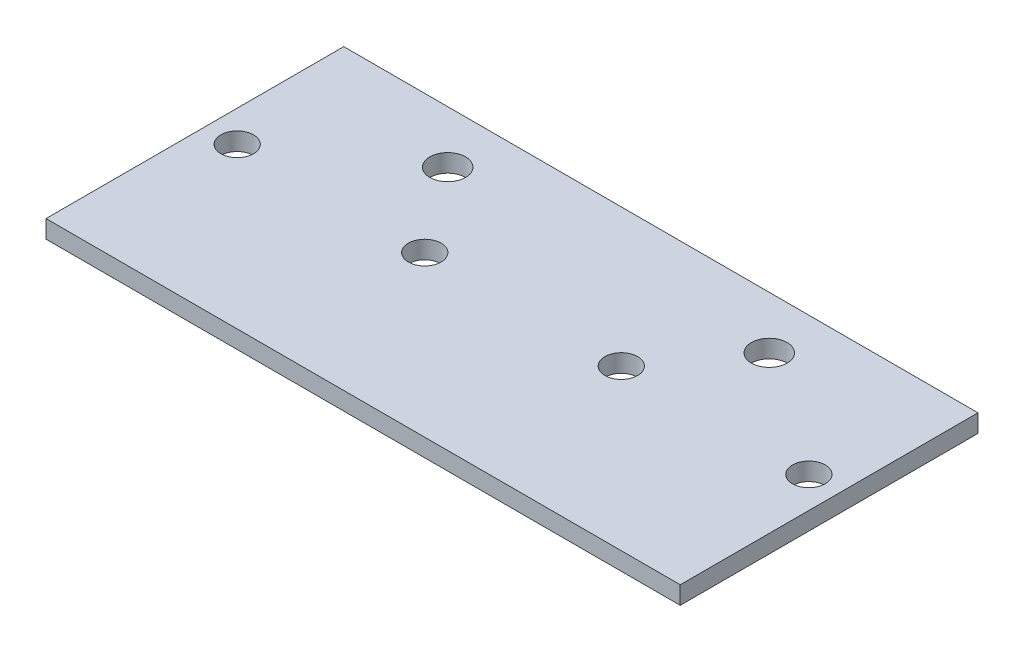
ISO-10303-21;
HEADER;
FILE_DESCRIPTION(('STEP AP214'),'2;1');
FILE_NAME('part.step','',(''),(''),'','','');
FILE_SCHEMA(('AUTOMOTIVE_DESIGN { 1 0 10303 214 1 1 1 1 }'));
ENDSEC;
DATA;
#1=APPLICATION_CONTEXT('core data for automotive mechanical design processes');
#2=APPLICATION_PROTOCOL_DEFINITION('international standard','automotive_design',2000,#1);
#3=PRODUCT_CONTEXT('',#1,'mechanical');
#4=PRODUCT('Part','Part','',(#3));
#5=PRODUCT_RELATED_PRODUCT_CATEGORY('part','',(#4));
#6=PRODUCT_DEFINITION_FORMATION('','',#4);
#7=PRODUCT_DEFINITION_CONTEXT('part definition',#1,'design');
#8=PRODUCT_DEFINITION('design','',#6,#7);
#9=PRODUCT_DEFINITION_SHAPE('','',#8);
#10=(LENGTH_UNIT() NAMED_UNIT(*) SI_UNIT(.MILLI.,.METRE.));
#11=(NAMED_UNIT(*) PLANE_ANGLE_UNIT() SI_UNIT($,.RADIAN.));
#12=(NAMED_UNIT(*) SI_UNIT($,.STERADIAN.) SOLID_ANGLE_UNIT());
#13=UNCERTAINTY_MEASURE_WITH_UNIT(LENGTH_MEASURE(1.E-05),#10,'distance_accuracy_value','');
#14=(GEOMETRIC_REPRESENTATION_CONTEXT(3) GLOBAL_UNCERTAINTY_ASSIGNED_CONTEXT((#13)) GLOBAL_UNIT_ASSIGNED_CONTEXT((#10,
#11,#12)) REPRESENTATION_CONTEXT('',''));
#15=CARTESIAN_POINT('',(0.,0.,0.));
#16=DIRECTION('',(0.,0.,1.));
#17=DIRECTION('',(1.,0.,0.));
#18=AXIS2_PLACEMENT_3D('',#15,#16,#17);
#19=CARTESIAN_POINT('',(53.25,3.,25.));
#20=DIRECTION('',(-1.,0.,0.));
#21=DIRECTION('',(0.,0.,1.));
#22=AXIS2_PLACEMENT_3D('',#19,#20,#21);
#23=PLANE('',#22);
#24=DIRECTION('',(0.,0.,-1.));
#25=VECTOR('',#24,1.);
#26=CARTESIAN_POINT('',(53.25,0.,25.));
#27=LINE('',#26,#25);
#28=CARTESIAN_POINT('',(53.25,0.,25.));
#29=VERTEX_POINT('',#28);
#30=CARTESIAN_POINT('',(53.25,0.,-25.));
#31=VERTEX_POINT('',#30);
#32=EDGE_CURVE('E95',#29,#31,#27,.T.);
#33=ORIENTED_EDGE('',*,*,#32,.T.);
#34=DIRECTION('',(0.,-1.,0.));
#35=VECTOR('',#34,1.);
#36=CARTESIAN_POINT('',(53.25,3.,-25.));
#37=LINE('',#36,#35);
#38=CARTESIAN_POINT('',(53.25,3.,-25.));
#39=VERTEX_POINT('',#38);
#40=EDGE_CURVE('E11',#39,#31,#37,.T.);
#41=ORIENTED_EDGE('',*,*,#40,.F.);
#42=DIRECTION('',(0.,0.,-1.));
#43=VECTOR('',#42,1.);
#44=CARTESIAN_POINT('',(53.25,3.,25.));
#45=LINE('',#44,#43);
#46=CARTESIAN_POINT('',(53.25,3.,25.));
#47=VERTEX_POINT('',#46);
#48=EDGE_CURVE('E83',#47,#39,#45,.T.);
#49=ORIENTED_EDGE('',*,*,#48,.F.);
#50=DIRECTION('',(0.,-1.,0.));
#51=VECTOR('',#50,1.);
#52=CARTESIAN_POINT('',(53.25,3.,25.));
#53=LINE('',#52,#51);
#54=EDGE_CURVE('E91',#47,#29,#53,.T.);
#55=ORIENTED_EDGE('',*,*,#54,.T.);
#56=EDGE_LOOP('',(#33,#41,#49,#55));
#57=FACE_BOUND('',#56,.T.);
#58=ADVANCED_FACE('F32',(#57),#23,.F.);
#59=CARTESIAN_POINT('',(-53.25,3.,-25.));
#60=DIRECTION('',(0.,0.,1.));
#61=DIRECTION('',(1.,0.,0.));
#62=AXIS2_PLACEMENT_3D('',#59,#60,#61);
#63=PLANE('',#62);
#64=DIRECTION('',(-1.,0.,0.));
#65=VECTOR('',#64,1.);
#66=CARTESIAN_POINT('',(-53.25,0.,-25.));
#67=LINE('',#66,#65);
#68=CARTESIAN_POINT('',(-53.25,0.,-25.));
#69=VERTEX_POINT('',#68);
#70=EDGE_CURVE('E87',#31,#69,#67,.T.);
#71=ORIENTED_EDGE('',*,*,#70,.T.);
#72=DIRECTION('',(0.,-1.,0.));
#73=VECTOR('',#72,1.);
#74=CARTESIAN_POINT('',(-53.25,3.,-25.));
#75=LINE('',#74,#73);
#76=CARTESIAN_POINT('',(-53.25,3.,-25.));
#77=VERTEX_POINT('',#76);
#78=EDGE_CURVE('E40',#77,#69,#75,.T.);
#79=ORIENTED_EDGE('',*,*,#78,.F.);
#80=DIRECTION('',(-1.,0.,0.));
#81=VECTOR('',#80,1.);
#82=CARTESIAN_POINT('',(-53.25,3.,-25.));
#83=LINE('',#82,#81);
#84=EDGE_CURVE('E78',#39,#77,#83,.T.);
#85=ORIENTED_EDGE('',*,*,#84,.F.);
#86=ORIENTED_EDGE('',*,*,#40,.T.);
#87=EDGE_LOOP('',(#71,#79,#85,#86));
#88=FACE_BOUND('',#87,.T.);
#89=ADVANCED_FACE('F86',(#88),#63,.F.);
#90=CARTESIAN_POINT('',(-53.25,3.,25.));
#91=DIRECTION('',(1.,0.,0.));
#92=DIRECTION('',(0.,0.,-1.));
#93=AXIS2_PLACEMENT_3D('',#90,#91,#92);
#94=PLANE('',#93);
#95=DIRECTION('',(0.,0.,1.));
#96=VECTOR('',#95,1.);
#97=CARTESIAN_POINT('',(-53.25,0.,25.));
#98=LINE('',#97,#96);
#99=CARTESIAN_POINT('',(-53.25,0.,25.));
#100=VERTEX_POINT('',#99);
#101=EDGE_CURVE('E65',#69,#100,#98,.T.);
#102=ORIENTED_EDGE('',*,*,#101,.T.);
#103=DIRECTION('',(0.,-1.,0.));
#104=VECTOR('',#103,1.);
#105=CARTESIAN_POINT('',(-53.25,3.,25.));
#106=LINE('',#105,#104);
#107=CARTESIAN_POINT('',(-53.25,3.,25.));
#108=VERTEX_POINT('',#107);
#109=EDGE_CURVE('E88',#108,#100,#106,.T.);
#110=ORIENTED_EDGE('',*,*,#109,.F.);
#111=DIRECTION('',(0.,0.,1.));
#112=VECTOR('',#111,1.);
#113=CARTESIAN_POINT('',(-53.25,3.,25.));
#114=LINE('',#113,#112);
#115=EDGE_CURVE('E81',#77,#108,#114,.T.);
#116=ORIENTED_EDGE('',*,*,#115,.F.);
#117=ORIENTED_EDGE('',*,*,#78,.T.);
#118=EDGE_LOOP('',(#102,#110,#116,#117));
#119=FACE_BOUND('',#118,.T.);
#120=ADVANCED_FACE('F89',(#119),#94,.F.);
#121=CARTESIAN_POINT('',(-53.25,3.,25.));
#122=DIRECTION('',(0.,0.,-1.));
#123=DIRECTION('',(-1.,0.,0.));
#124=AXIS2_PLACEMENT_3D('',#121,#122,#123);
#125=PLANE('',#124);
#126=DIRECTION('',(1.,0.,0.));
#127=VECTOR('',#126,1.);
#128=CARTESIAN_POINT('',(-53.25,0.,25.));
#129=LINE('',#128,#127);
#130=EDGE_CURVE('E71',#100,#29,#129,.T.);
#131=ORIENTED_EDGE('',*,*,#130,.T.);
#132=ORIENTED_EDGE('',*,*,#54,.F.);
#133=DIRECTION('',(1.,0.,0.));
#134=VECTOR('',#133,1.);
#135=CARTESIAN_POINT('',(-53.25,3.,25.));
#136=LINE('',#135,#134);
#137=EDGE_CURVE('E48',#108,#47,#136,.T.);
#138=ORIENTED_EDGE('',*,*,#137,.F.);
#139=ORIENTED_EDGE('',*,*,#109,.T.);
#140=EDGE_LOOP('',(#131,#132,#138,#139));
#141=FACE_BOUND('',#140,.T.);
#142=ADVANCED_FACE('F103',(#141),#125,.F.);
#143=CARTESIAN_POINT('',(0.,3.,0.));
#144=DIRECTION('',(0.,-1.,0.));
#145=DIRECTION('',(0.,0.,-1.));
#146=AXIS2_PLACEMENT_3D('',#143,#144,#145);
#147=PLANE('',#146);
#148=CARTESIAN_POINT('',(-26.9999999999996,3.,-16.2000000000578));
#149=DIRECTION('',(0.,1.,0.));
#150=DIRECTION('',(0.,0.,1.));
#151=AXIS2_PLACEMENT_3D('',#148,#149,#150);
#152=CIRCLE('',#151,3.00000000000002);
#153=CARTESIAN_POINT('',(-26.9999999999996,3.,-13.2000000000578));
#154=VERTEX_POINT('',#153);
#155=EDGE_CURVE('E139',#154,#154,#152,.T.);
#156=ORIENTED_EDGE('',*,*,#155,.F.);
#157=EDGE_LOOP('',(#156));
#158=FACE_BOUND('',#157,.T.);
#159=CARTESIAN_POINT('',(27.0000000000004,3.,-16.2000000000578));
#160=DIRECTION('',(0.,1.,0.));
#161=DIRECTION('',(0.,0.,1.));
#162=AXIS2_PLACEMENT_3D('',#159,#160,#161);
#163=CIRCLE('',#162,2.99999999999999);
#164=CARTESIAN_POINT('',(27.0000000000004,3.,-13.2000000000578));
#165=VERTEX_POINT('',#164);
#166=EDGE_CURVE('E133',#165,#165,#163,.T.);
#167=ORIENTED_EDGE('',*,*,#166,.F.);
#168=EDGE_LOOP('',(#167));
#169=FACE_BOUND('',#168,.T.);
#170=CARTESIAN_POINT('',(-47.9999999999934,3.,-1.8500000000346));
#171=DIRECTION('',(0.,1.,0.));
#172=DIRECTION('',(0.,0.,1.));
#173=AXIS2_PLACEMENT_3D('',#170,#171,#172);
#174=CIRCLE('',#173,2.74999999999999);
#175=CARTESIAN_POINT('',(-47.9999999999934,3.,0.899999999965393));
#176=VERTEX_POINT('',#175);
#177=EDGE_CURVE('E127',#176,#176,#174,.T.);
#178=ORIENTED_EDGE('',*,*,#177,.F.);
#179=EDGE_LOOP('',(#178));
#180=FACE_BOUND('',#179,.T.);
#181=CARTESIAN_POINT('',(-16.4999999999934,3.,-1.8500000000346));
#182=DIRECTION('',(0.,1.,0.));
#183=DIRECTION('',(0.,0.,1.));
#184=AXIS2_PLACEMENT_3D('',#181,#182,#183);
#185=CIRCLE('',#184,2.75000000000002);
#186=CARTESIAN_POINT('',(-16.4999999999934,3.,0.89999999996542));
#187=VERTEX_POINT('',#186);
#188=EDGE_CURVE('E121',#187,#187,#185,.T.);
#189=ORIENTED_EDGE('',*,*,#188,.F.);
#190=EDGE_LOOP('',(#189));
#191=FACE_BOUND('',#190,.T.);
#192=CARTESIAN_POINT('',(16.5000000000057,3.,-1.85000000006413));
#193=DIRECTION('',(0.,1.,0.));
#194=DIRECTION('',(0.,0.,1.));
#195=AXIS2_PLACEMENT_3D('',#192,#193,#194);
#196=CIRCLE('',#195,2.75000000000002);
#197=CARTESIAN_POINT('',(16.5000000000057,3.,0.899999999935885));
#198=VERTEX_POINT('',#197);
#199=EDGE_CURVE('E115',#198,#198,#196,.T.);
#200=ORIENTED_EDGE('',*,*,#199,.F.);
#201=EDGE_LOOP('',(#200));
#202=FACE_BOUND('',#201,.T.);
#203=CARTESIAN_POINT('',(48.0000000000057,3.,-1.85000000006413));
#204=DIRECTION('',(0.,1.,0.));
#205=DIRECTION('',(0.,0.,1.));
#206=AXIS2_PLACEMENT_3D('',#203,#204,#205);
#207=CIRCLE('',#206,2.74999999999999);
#208=CARTESIAN_POINT('',(48.0000000000057,3.,0.899999999935861));
#209=VERTEX_POINT('',#208);
#210=EDGE_CURVE('E109',#209,#209,#207,.T.);
#211=ORIENTED_EDGE('',*,*,#210,.F.);
#212=EDGE_LOOP('',(#211));
#213=FACE_BOUND('',#212,.T.);
#214=ORIENTED_EDGE('',*,*,#48,.T.);
#215=ORIENTED_EDGE('',*,*,#84,.T.);
#216=ORIENTED_EDGE('',*,*,#115,.T.);
#217=ORIENTED_EDGE('',*,*,#137,.T.);
#218=EDGE_LOOP('',(#214,#215,#216,#217));
#219=FACE_BOUND('',#218,.T.);
#220=ADVANCED_FACE('F79',(#158,#169,#180,#191,#202,#213,#219),#147,.F.);
#221=CARTESIAN_POINT('',(0.,0.,0.));
#222=DIRECTION('',(0.,-1.,0.));
#223=DIRECTION('',(0.,0.,-1.));
#224=AXIS2_PLACEMENT_3D('',#221,#222,#223);
#225=PLANE('',#224);
#226=CARTESIAN_POINT('',(-26.9999999999996,0.,-16.2000000000578));
#227=DIRECTION('',(0.,1.,0.));
#228=DIRECTION('',(0.,0.,1.));
#229=AXIS2_PLACEMENT_3D('',#226,#227,#228);
#230=CIRCLE('',#229,3.00000000000002);
#231=CARTESIAN_POINT('',(-26.9999999999996,0.,-13.2000000000578));
#232=VERTEX_POINT('',#231);
#233=EDGE_CURVE('E136',#232,#232,#230,.T.);
#234=ORIENTED_EDGE('',*,*,#233,.T.);
#235=EDGE_LOOP('',(#234));
#236=FACE_BOUND('',#235,.T.);
#237=CARTESIAN_POINT('',(27.0000000000004,0.,-16.2000000000578));
#238=DIRECTION('',(0.,1.,0.));
#239=DIRECTION('',(0.,0.,1.));
#240=AXIS2_PLACEMENT_3D('',#237,#238,#239);
#241=CIRCLE('',#240,2.99999999999999);
#242=CARTESIAN_POINT('',(27.0000000000004,0.,-13.2000000000578));
#243=VERTEX_POINT('',#242);
#244=EDGE_CURVE('E130',#243,#243,#241,.T.);
#245=ORIENTED_EDGE('',*,*,#244,.T.);
#246=EDGE_LOOP('',(#245));
#247=FACE_BOUND('',#246,.T.);
#248=CARTESIAN_POINT('',(-47.9999999999934,0.,-1.8500000000346));
#249=DIRECTION('',(0.,1.,0.));
#250=DIRECTION('',(0.,0.,1.));
#251=AXIS2_PLACEMENT_3D('',#248,#249,#250);
#252=CIRCLE('',#251,2.74999999999999);
#253=CARTESIAN_POINT('',(-47.9999999999934,0.,0.899999999965393));
#254=VERTEX_POINT('',#253);
#255=EDGE_CURVE('E124',#254,#254,#252,.T.);
#256=ORIENTED_EDGE('',*,*,#255,.T.);
#257=EDGE_LOOP('',(#256));
#258=FACE_BOUND('',#257,.T.);
#259=CARTESIAN_POINT('',(-16.4999999999934,0.,-1.8500000000346));
#260=DIRECTION('',(0.,1.,0.));
#261=DIRECTION('',(0.,0.,1.));
#262=AXIS2_PLACEMENT_3D('',#259,#260,#261);
#263=CIRCLE('',#262,2.75000000000002);
#264=CARTESIAN_POINT('',(-16.4999999999934,0.,0.89999999996542));
#265=VERTEX_POINT('',#264);
#266=EDGE_CURVE('E118',#265,#265,#263,.T.);
#267=ORIENTED_EDGE('',*,*,#266,.T.);
#268=EDGE_LOOP('',(#267));
#269=FACE_BOUND('',#268,.T.);
#270=CARTESIAN_POINT('',(16.5000000000057,0.,-1.85000000006413));
#271=DIRECTION('',(0.,1.,0.));
#272=DIRECTION('',(0.,0.,1.));
#273=AXIS2_PLACEMENT_3D('',#270,#271,#272);
#274=CIRCLE('',#273,2.75000000000002);
#275=CARTESIAN_POINT('',(16.5000000000057,0.,0.899999999935885));
#276=VERTEX_POINT('',#275);
#277=EDGE_CURVE('E112',#276,#276,#274,.T.);
#278=ORIENTED_EDGE('',*,*,#277,.T.);
#279=EDGE_LOOP('',(#278));
#280=FACE_BOUND('',#279,.T.);
#281=CARTESIAN_POINT('',(48.0000000000057,0.,-1.85000000006413));
#282=DIRECTION('',(0.,1.,0.));
#283=DIRECTION('',(0.,0.,1.));
#284=AXIS2_PLACEMENT_3D('',#281,#282,#283);
#285=CIRCLE('',#284,2.74999999999999);
#286=CARTESIAN_POINT('',(48.0000000000057,0.,0.899999999935861));
#287=VERTEX_POINT('',#286);
#288=EDGE_CURVE('E98',#287,#287,#285,.T.);
#289=ORIENTED_EDGE('',*,*,#288,.T.);
#290=EDGE_LOOP('',(#289));
#291=FACE_BOUND('',#290,.T.);
#292=ORIENTED_EDGE('',*,*,#32,.F.);
#293=ORIENTED_EDGE('',*,*,#130,.F.);
#294=ORIENTED_EDGE('',*,*,#101,.F.);
#295=ORIENTED_EDGE('',*,*,#70,.F.);
#296=EDGE_LOOP('',(#292,#293,#294,#295));
#297=FACE_BOUND('',#296,.T.);
#298=ADVANCED_FACE('F106',(#236,#247,#258,#269,#280,#291,#297),#225,.T.);
#299=CARTESIAN_POINT('',(48.0000000000057,0.,-1.85000000006413));
#300=DIRECTION('',(0.,1.,0.));
#301=DIRECTION('',(0.,0.,1.));
#302=AXIS2_PLACEMENT_3D('',#299,#300,#301);
#303=CYLINDRICAL_SURFACE('',#302,2.74999999999999);
#304=ORIENTED_EDGE('',*,*,#288,.F.);
#305=EDGE_LOOP('',(#304));
#306=FACE_BOUND('',#305,.T.);
#307=ORIENTED_EDGE('',*,*,#210,.T.);
#308=EDGE_LOOP('',(#307));
#309=FACE_BOUND('',#308,.T.);
#310=ADVANCED_FACE('F167',(#306,#309),#303,.F.);
#311=CARTESIAN_POINT('',(16.5000000000057,0.,-1.85000000006413));
#312=DIRECTION('',(0.,1.,0.));
#313=DIRECTION('',(0.,0.,1.));
#314=AXIS2_PLACEMENT_3D('',#311,#312,#313);
#315=CYLINDRICAL_SURFACE('',#314,2.75000000000002);
#316=ORIENTED_EDGE('',*,*,#277,.F.);
#317=EDGE_LOOP('',(#316));
#318=FACE_BOUND('',#317,.T.);
#319=ORIENTED_EDGE('',*,*,#199,.T.);
#320=EDGE_LOOP('',(#319));
#321=FACE_BOUND('',#320,.T.);
#322=ADVANCED_FACE('F169',(#318,#321),#315,.F.);
#323=CARTESIAN_POINT('',(-16.4999999999934,0.,-1.8500000000346));
#324=DIRECTION('',(0.,1.,0.));
#325=DIRECTION('',(0.,0.,1.));
#326=AXIS2_PLACEMENT_3D('',#323,#324,#325);
#327=CYLINDRICAL_SURFACE('',#326,2.75000000000002);
#328=ORIENTED_EDGE('',*,*,#266,.F.);
#329=EDGE_LOOP('',(#328));
#330=FACE_BOUND('',#329,.T.);
#331=ORIENTED_EDGE('',*,*,#188,.T.);
#332=EDGE_LOOP('',(#331));
#333=FACE_BOUND('',#332,.T.);
#334=ADVANCED_FACE('F176',(#330,#333),#327,.F.);
#335=CARTESIAN_POINT('',(-47.9999999999934,0.,-1.8500000000346));
#336=DIRECTION('',(0.,1.,0.));
#337=DIRECTION('',(0.,0.,1.));
#338=AXIS2_PLACEMENT_3D('',#335,#336,#337);
#339=CYLINDRICAL_SURFACE('',#338,2.74999999999999);
#340=ORIENTED_EDGE('',*,*,#255,.F.);
#341=EDGE_LOOP('',(#340));
#342=FACE_BOUND('',#341,.T.);
#343=ORIENTED_EDGE('',*,*,#177,.T.);
#344=EDGE_LOOP('',(#343));
#345=FACE_BOUND('',#344,.T.);
#346=ADVANCED_FACE('F224',(#342,#345),#339,.F.);
#347=CARTESIAN_POINT('',(27.0000000000004,0.,-16.2000000000578));
#348=DIRECTION('',(0.,1.,0.));
#349=DIRECTION('',(0.,0.,1.));
#350=AXIS2_PLACEMENT_3D('',#347,#348,#349);
#351=CYLINDRICAL_SURFACE('',#350,2.99999999999999);
#352=ORIENTED_EDGE('',*,*,#244,.F.);
#353=EDGE_LOOP('',(#352));
#354=FACE_BOUND('',#353,.T.);
#355=ORIENTED_EDGE('',*,*,#166,.T.);
#356=EDGE_LOOP('',(#355));
#357=FACE_BOUND('',#356,.T.);
#358=ADVANCED_FACE('F150',(#354,#357),#351,.F.);
#359=CARTESIAN_POINT('',(-26.9999999999996,0.,-16.2000000000578));
#360=DIRECTION('',(0.,1.,0.));
#361=DIRECTION('',(0.,0.,1.));
#362=AXIS2_PLACEMENT_3D('',#359,#360,#361);
#363=CYLINDRICAL_SURFACE('',#362,3.00000000000002);
#364=ORIENTED_EDGE('',*,*,#233,.F.);
#365=EDGE_LOOP('',(#364));
#366=FACE_BOUND('',#365,.T.);
#367=ORIENTED_EDGE('',*,*,#155,.T.);
#368=EDGE_LOOP('',(#367));
#369=FACE_BOUND('',#368,.T.);
#370=ADVANCED_FACE('F147',(#366,#369),#363,.F.);
#371=CLOSED_SHELL('',(#58,#89,#120,#142,#220,#298,#310,#322,#334,#346,#358,#370));
#372=MANIFOLD_SOLID_BREP('B2',#371);
#373=ADVANCED_BREP_SHAPE_REPRESENTATION('',(#18,#372),#14);
#374=SHAPE_DEFINITION_REPRESENTATION(#9,#373);
ENDSEC;
END-ISO-10303-21;
